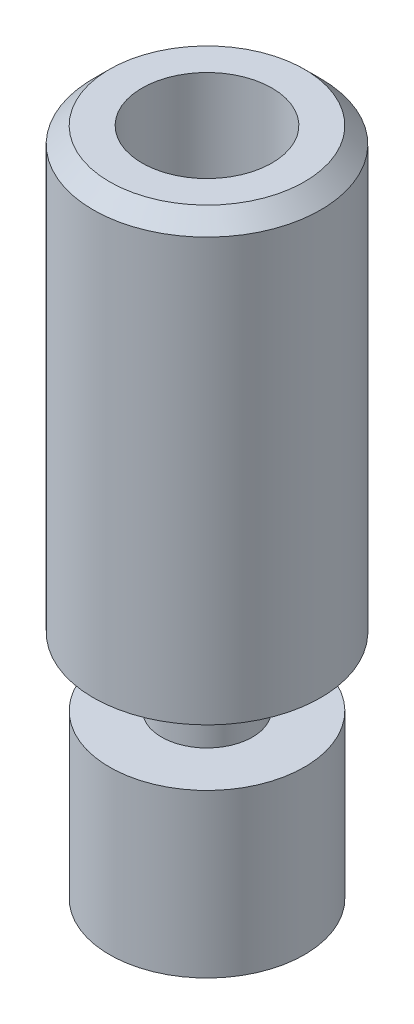
ISO-10303-21;
HEADER;
FILE_DESCRIPTION(('STEP AP214'),'2;1');
FILE_NAME('part.step','',(''),(''),'','','');
FILE_SCHEMA(('AUTOMOTIVE_DESIGN { 1 0 10303 214 1 1 1 1 }'));
ENDSEC;
DATA;
#1=APPLICATION_CONTEXT('core data for automotive mechanical design processes');
#2=APPLICATION_PROTOCOL_DEFINITION('international standard','automotive_design',2000,#1);
#3=PRODUCT_CONTEXT('',#1,'mechanical');
#4=PRODUCT('Part','Part','',(#3));
#5=PRODUCT_RELATED_PRODUCT_CATEGORY('part','',(#4));
#6=PRODUCT_DEFINITION_FORMATION('','',#4);
#7=PRODUCT_DEFINITION_CONTEXT('part definition',#1,'design');
#8=PRODUCT_DEFINITION('design','',#6,#7);
#9=PRODUCT_DEFINITION_SHAPE('','',#8);
#10=(LENGTH_UNIT() NAMED_UNIT(*) SI_UNIT(.MILLI.,.METRE.));
#11=(NAMED_UNIT(*) PLANE_ANGLE_UNIT() SI_UNIT($,.RADIAN.));
#12=(NAMED_UNIT(*) SI_UNIT($,.STERADIAN.) SOLID_ANGLE_UNIT());
#13=UNCERTAINTY_MEASURE_WITH_UNIT(LENGTH_MEASURE(1.E-05),#10,'distance_accuracy_value','');
#14=(GEOMETRIC_REPRESENTATION_CONTEXT(3) GLOBAL_UNCERTAINTY_ASSIGNED_CONTEXT((#13)) GLOBAL_UNIT_ASSIGNED_CONTEXT((#10,
#11,#12)) REPRESENTATION_CONTEXT('',''));
#15=CARTESIAN_POINT('',(0.,0.,0.));
#16=DIRECTION('',(0.,0.,1.));
#17=DIRECTION('',(1.,0.,0.));
#18=AXIS2_PLACEMENT_3D('',#15,#16,#17);
#19=CARTESIAN_POINT('',(0.,-10.3,0.));
#20=DIRECTION('',(0.,-1.,0.));
#21=DIRECTION('',(0.,0.,-1.));
#22=AXIS2_PLACEMENT_3D('',#19,#20,#21);
#23=CYLINDRICAL_SURFACE('',#22,3.);
#24=CARTESIAN_POINT('',(0.,-5.3,0.));
#25=DIRECTION('',(0.,-1.,0.));
#26=DIRECTION('',(0.,0.,-1.));
#27=AXIS2_PLACEMENT_3D('',#24,#25,#26);
#28=CIRCLE('',#27,3.);
#29=CARTESIAN_POINT('',(0.,-5.3,-3.));
#30=VERTEX_POINT('',#29);
#31=EDGE_CURVE('E43',#30,#30,#28,.T.);
#32=ORIENTED_EDGE('',*,*,#31,.T.);
#33=EDGE_LOOP('',(#32));
#34=FACE_BOUND('',#33,.T.);
#35=CARTESIAN_POINT('',(0.,-10.3,0.));
#36=DIRECTION('',(0.,-1.,0.));
#37=DIRECTION('',(0.,0.,-1.));
#38=AXIS2_PLACEMENT_3D('',#35,#36,#37);
#39=CIRCLE('',#38,3.);
#40=CARTESIAN_POINT('',(0.,-10.3,-3.));
#41=VERTEX_POINT('',#40);
#42=EDGE_CURVE('E70',#41,#41,#39,.T.);
#43=ORIENTED_EDGE('',*,*,#42,.F.);
#44=EDGE_LOOP('',(#43));
#45=FACE_BOUND('',#44,.T.);
#46=ADVANCED_FACE('F32',(#34,#45),#23,.T.);
#47=CARTESIAN_POINT('',(3.,-5.3,0.));
#48=DIRECTION('',(0.,1.,0.));
#49=DIRECTION('',(0.,0.,1.));
#50=AXIS2_PLACEMENT_3D('',#47,#48,#49);
#51=PLANE('',#50);
#52=CARTESIAN_POINT('',(0.,-5.3,0.));
#53=DIRECTION('',(0.,-1.,0.));
#54=DIRECTION('',(0.,0.,-1.));
#55=AXIS2_PLACEMENT_3D('',#52,#53,#54);
#56=CIRCLE('',#55,1.4);
#57=CARTESIAN_POINT('',(0.,-5.3,-1.4));
#58=VERTEX_POINT('',#57);
#59=EDGE_CURVE('E47',#58,#58,#56,.T.);
#60=ORIENTED_EDGE('',*,*,#59,.T.);
#61=EDGE_LOOP('',(#60));
#62=FACE_BOUND('',#61,.T.);
#63=ORIENTED_EDGE('',*,*,#31,.F.);
#64=EDGE_LOOP('',(#63));
#65=FACE_BOUND('',#64,.T.);
#66=ADVANCED_FACE('F78',(#62,#65),#51,.T.);
#67=CARTESIAN_POINT('',(0.,-10.3,0.));
#68=DIRECTION('',(0.,-1.,0.));
#69=DIRECTION('',(0.,0.,-1.));
#70=AXIS2_PLACEMENT_3D('',#67,#68,#69);
#71=CYLINDRICAL_SURFACE('',#70,1.4);
#72=CARTESIAN_POINT('',(0.,-3.2,0.));
#73=DIRECTION('',(0.,-1.,0.));
#74=DIRECTION('',(0.,0.,-1.));
#75=AXIS2_PLACEMENT_3D('',#72,#73,#74);
#76=CIRCLE('',#75,1.4);
#77=CARTESIAN_POINT('',(0.,-3.2,-1.4));
#78=VERTEX_POINT('',#77);
#79=EDGE_CURVE('E52',#78,#78,#76,.T.);
#80=ORIENTED_EDGE('',*,*,#79,.T.);
#81=EDGE_LOOP('',(#80));
#82=FACE_BOUND('',#81,.T.);
#83=ORIENTED_EDGE('',*,*,#59,.F.);
#84=EDGE_LOOP('',(#83));
#85=FACE_BOUND('',#84,.T.);
#86=ADVANCED_FACE('F83',(#82,#85),#71,.T.);
#87=CARTESIAN_POINT('',(1.4,-3.2,0.));
#88=DIRECTION('',(0.,-1.,0.));
#89=DIRECTION('',(0.,0.,-1.));
#90=AXIS2_PLACEMENT_3D('',#87,#88,#89);
#91=PLANE('',#90);
#92=CARTESIAN_POINT('',(0.,-3.2,0.));
#93=DIRECTION('',(0.,-1.,0.));
#94=DIRECTION('',(0.,0.,-1.));
#95=AXIS2_PLACEMENT_3D('',#92,#93,#94);
#96=CIRCLE('',#95,3.5);
#97=CARTESIAN_POINT('',(0.,-3.2,-3.5));
#98=VERTEX_POINT('',#97);
#99=EDGE_CURVE('E55',#98,#98,#96,.T.);
#100=ORIENTED_EDGE('',*,*,#99,.T.);
#101=EDGE_LOOP('',(#100));
#102=FACE_BOUND('',#101,.T.);
#103=ORIENTED_EDGE('',*,*,#79,.F.);
#104=EDGE_LOOP('',(#103));
#105=FACE_BOUND('',#104,.T.);
#106=ADVANCED_FACE('F89',(#102,#105),#91,.T.);
#107=CARTESIAN_POINT('',(0.,-10.3,0.));
#108=DIRECTION('',(0.,-1.,0.));
#109=DIRECTION('',(0.,0.,-1.));
#110=AXIS2_PLACEMENT_3D('',#107,#108,#109);
#111=CYLINDRICAL_SURFACE('',#110,3.5);
#112=CARTESIAN_POINT('',(0.,9.79999999999999,0.));
#113=DIRECTION('',(0.,1.,0.));
#114=DIRECTION('',(0.,0.,1.));
#115=AXIS2_PLACEMENT_3D('',#112,#113,#114);
#116=CIRCLE('',#115,3.5);
#117=CARTESIAN_POINT('',(0.,9.79999999999999,3.5));
#118=VERTEX_POINT('',#117);
#119=EDGE_CURVE('E39',#118,#118,#116,.F.);
#120=ORIENTED_EDGE('',*,*,#119,.T.);
#121=EDGE_LOOP('',(#120));
#122=FACE_BOUND('',#121,.T.);
#123=ORIENTED_EDGE('',*,*,#99,.F.);
#124=EDGE_LOOP('',(#123));
#125=FACE_BOUND('',#124,.T.);
#126=ADVANCED_FACE('F93',(#122,#125),#111,.T.);
#127=CARTESIAN_POINT('',(3.5,10.3,0.));
#128=DIRECTION('',(0.,1.,0.));
#129=DIRECTION('',(0.,0.,1.));
#130=AXIS2_PLACEMENT_3D('',#127,#128,#129);
#131=PLANE('',#130);
#132=CARTESIAN_POINT('',(0.,10.3,0.));
#133=DIRECTION('',(0.,1.,0.));
#134=DIRECTION('',(0.,0.,1.));
#135=AXIS2_PLACEMENT_3D('',#132,#133,#134);
#136=CIRCLE('',#135,2.99999999999999);
#137=CARTESIAN_POINT('',(0.,10.3,2.99999999999999));
#138=VERTEX_POINT('',#137);
#139=EDGE_CURVE('E10',#138,#138,#136,.T.);
#140=ORIENTED_EDGE('',*,*,#139,.T.);
#141=EDGE_LOOP('',(#140));
#142=FACE_BOUND('',#141,.T.);
#143=CARTESIAN_POINT('',(0.,10.3,0.));
#144=DIRECTION('',(0.,-1.,0.));
#145=DIRECTION('',(0.,0.,-1.));
#146=AXIS2_PLACEMENT_3D('',#143,#144,#145);
#147=CIRCLE('',#146,2.);
#148=CARTESIAN_POINT('',(0.,10.3,-2.));
#149=VERTEX_POINT('',#148);
#150=EDGE_CURVE('E58',#149,#149,#147,.T.);
#151=ORIENTED_EDGE('',*,*,#150,.T.);
#152=EDGE_LOOP('',(#151));
#153=FACE_BOUND('',#152,.T.);
#154=ADVANCED_FACE('F97',(#142,#153),#131,.T.);
#155=CARTESIAN_POINT('',(0.,-10.3,0.));
#156=DIRECTION('',(0.,-1.,0.));
#157=DIRECTION('',(0.,0.,-1.));
#158=AXIS2_PLACEMENT_3D('',#155,#156,#157);
#159=CYLINDRICAL_SURFACE('',#158,2.);
#160=CARTESIAN_POINT('',(0.,6.3,0.));
#161=DIRECTION('',(0.,-1.,0.));
#162=DIRECTION('',(0.,0.,-1.));
#163=AXIS2_PLACEMENT_3D('',#160,#161,#162);
#164=CIRCLE('',#163,2.);
#165=CARTESIAN_POINT('',(0.,6.3,-2.));
#166=VERTEX_POINT('',#165);
#167=EDGE_CURVE('E61',#166,#166,#164,.T.);
#168=ORIENTED_EDGE('',*,*,#167,.T.);
#169=EDGE_LOOP('',(#168));
#170=FACE_BOUND('',#169,.T.);
#171=ORIENTED_EDGE('',*,*,#150,.F.);
#172=EDGE_LOOP('',(#171));
#173=FACE_BOUND('',#172,.T.);
#174=ADVANCED_FACE('F100',(#170,#173),#159,.F.);
#175=CARTESIAN_POINT('',(0.,6.3,0.));
#176=DIRECTION('',(0.,1.,0.));
#177=DIRECTION('',(0.,0.,1.));
#178=AXIS2_PLACEMENT_3D('',#175,#176,#177);
#179=CONICAL_SURFACE('',#178,2.,1.0471975511966);
#180=CARTESIAN_POINT('',(0.,5.72264973081038,0.));
#181=DIRECTION('',(0.,-1.,0.));
#182=DIRECTION('',(0.,0.,-1.));
#183=AXIS2_PLACEMENT_3D('',#180,#181,#182);
#184=CIRCLE('',#183,1.);
#185=CARTESIAN_POINT('',(0.,5.72264973081038,-1.));
#186=VERTEX_POINT('',#185);
#187=EDGE_CURVE('E64',#186,#186,#184,.T.);
#188=ORIENTED_EDGE('',*,*,#187,.T.);
#189=EDGE_LOOP('',(#188));
#190=FACE_BOUND('',#189,.T.);
#191=ORIENTED_EDGE('',*,*,#167,.F.);
#192=EDGE_LOOP('',(#191));
#193=FACE_BOUND('',#192,.T.);
#194=ADVANCED_FACE('F103',(#190,#193),#179,.F.);
#195=CARTESIAN_POINT('',(0.,-10.3,0.));
#196=DIRECTION('',(0.,-1.,0.));
#197=DIRECTION('',(0.,0.,-1.));
#198=AXIS2_PLACEMENT_3D('',#195,#196,#197);
#199=CYLINDRICAL_SURFACE('',#198,1.);
#200=CARTESIAN_POINT('',(0.,-10.3,0.));
#201=DIRECTION('',(0.,-1.,0.));
#202=DIRECTION('',(0.,0.,-1.));
#203=AXIS2_PLACEMENT_3D('',#200,#201,#202);
#204=CIRCLE('',#203,1.);
#205=CARTESIAN_POINT('',(0.,-10.3,-1.));
#206=VERTEX_POINT('',#205);
#207=EDGE_CURVE('E67',#206,#206,#204,.T.);
#208=ORIENTED_EDGE('',*,*,#207,.T.);
#209=EDGE_LOOP('',(#208));
#210=FACE_BOUND('',#209,.T.);
#211=ORIENTED_EDGE('',*,*,#187,.F.);
#212=EDGE_LOOP('',(#211));
#213=FACE_BOUND('',#212,.T.);
#214=ADVANCED_FACE('F107',(#210,#213),#199,.F.);
#215=CARTESIAN_POINT('',(1.,-10.3,0.));
#216=DIRECTION('',(0.,-1.,0.));
#217=DIRECTION('',(0.,0.,-1.));
#218=AXIS2_PLACEMENT_3D('',#215,#216,#217);
#219=PLANE('',#218);
#220=ORIENTED_EDGE('',*,*,#42,.T.);
#221=EDGE_LOOP('',(#220));
#222=FACE_BOUND('',#221,.T.);
#223=ORIENTED_EDGE('',*,*,#207,.F.);
#224=EDGE_LOOP('',(#223));
#225=FACE_BOUND('',#224,.T.);
#226=ADVANCED_FACE('F74',(#222,#225),#219,.T.);
#227=CARTESIAN_POINT('',(0.,9.79999999999999,0.));
#228=DIRECTION('',(0.,-1.,0.));
#229=DIRECTION('',(0.,0.,-1.));
#230=AXIS2_PLACEMENT_3D('',#227,#228,#229);
#231=CONICAL_SURFACE('',#230,3.5,0.785398163397449);
#232=ORIENTED_EDGE('',*,*,#139,.F.);
#233=EDGE_LOOP('',(#232));
#234=FACE_BOUND('',#233,.T.);
#235=ORIENTED_EDGE('',*,*,#119,.F.);
#236=EDGE_LOOP('',(#235));
#237=FACE_BOUND('',#236,.T.);
#238=ADVANCED_FACE('F34',(#234,#237),#231,.T.);
#239=CLOSED_SHELL('',(#46,#66,#86,#106,#126,#154,#174,#194,#214,#226,#238));
#240=MANIFOLD_SOLID_BREP('B2',#239);
#241=ADVANCED_BREP_SHAPE_REPRESENTATION('',(#18,#240),#14);
#242=SHAPE_DEFINITION_REPRESENTATION(#9,#241);
ENDSEC;
END-ISO-10303-21;
